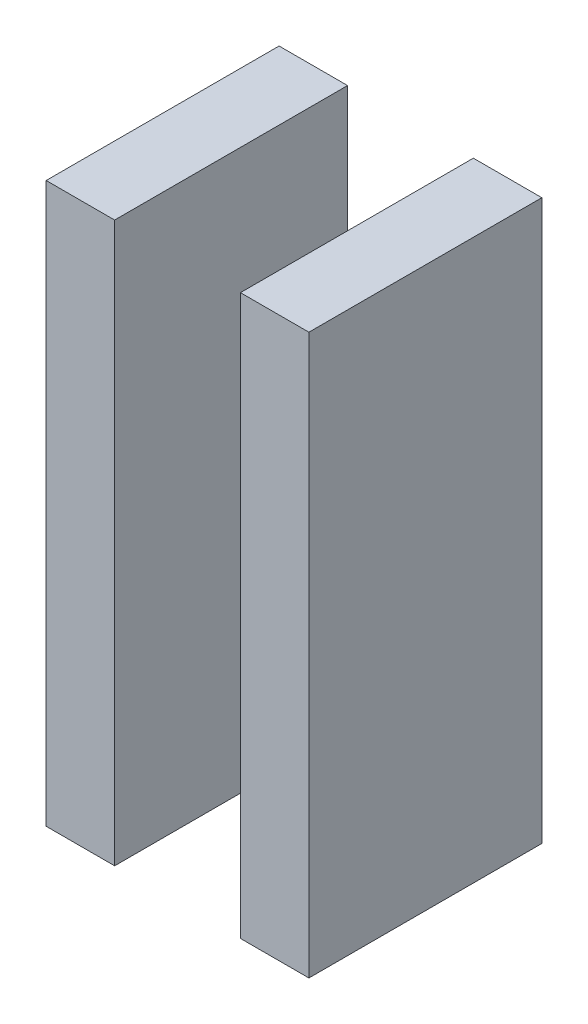
ISO-10303-21;
HEADER;
FILE_DESCRIPTION(('STEP AP214'),'2;1');
FILE_NAME('part.step','',(''),(''),'','','');
FILE_SCHEMA(('AUTOMOTIVE_DESIGN { 1 0 10303 214 1 1 1 1 }'));
ENDSEC;
DATA;
#1=APPLICATION_CONTEXT('core data for automotive mechanical design processes');
#2=APPLICATION_PROTOCOL_DEFINITION('international standard','automotive_design',2000,#1);
#3=PRODUCT_CONTEXT('',#1,'mechanical');
#4=PRODUCT('Part','Part','',(#3));
#5=PRODUCT_RELATED_PRODUCT_CATEGORY('part','',(#4));
#6=PRODUCT_DEFINITION_FORMATION('','',#4);
#7=PRODUCT_DEFINITION_CONTEXT('part definition',#1,'design');
#8=PRODUCT_DEFINITION('design','',#6,#7);
#9=PRODUCT_DEFINITION_SHAPE('','',#8);
#10=(LENGTH_UNIT() NAMED_UNIT(*) SI_UNIT(.MILLI.,.METRE.));
#11=(NAMED_UNIT(*) PLANE_ANGLE_UNIT() SI_UNIT($,.RADIAN.));
#12=(NAMED_UNIT(*) SI_UNIT($,.STERADIAN.) SOLID_ANGLE_UNIT());
#13=UNCERTAINTY_MEASURE_WITH_UNIT(LENGTH_MEASURE(1.E-05),#10,'distance_accuracy_value','');
#14=(GEOMETRIC_REPRESENTATION_CONTEXT(3) GLOBAL_UNCERTAINTY_ASSIGNED_CONTEXT((#13)) GLOBAL_UNIT_ASSIGNED_CONTEXT((#10,
#11,#12)) REPRESENTATION_CONTEXT('',''));
#15=CARTESIAN_POINT('',(0.,0.,0.));
#16=DIRECTION('',(0.,0.,1.));
#17=DIRECTION('',(1.,0.,0.));
#18=AXIS2_PLACEMENT_3D('',#15,#16,#17);
#19=CARTESIAN_POINT('',(203.31,-34.095,10.));
#20=DIRECTION('',(0.,-1.,0.));
#21=DIRECTION('',(0.,0.,-1.));
#22=AXIS2_PLACEMENT_3D('',#19,#20,#21);
#23=PLANE('',#22);
#24=DIRECTION('',(-1.,0.,0.));
#25=VECTOR('',#24,1.);
#26=CARTESIAN_POINT('',(203.31,-34.095,0.));
#27=LINE('',#26,#25);
#28=CARTESIAN_POINT('',(203.31,-34.095,0.));
#29=VERTEX_POINT('',#28);
#30=CARTESIAN_POINT('',(200.37,-34.095,0.));
#31=VERTEX_POINT('',#30);
#32=EDGE_CURVE('E12',#29,#31,#27,.T.);
#33=ORIENTED_EDGE('',*,*,#32,.T.);
#34=DIRECTION('',(0.,0.,-1.));
#35=VECTOR('',#34,1.);
#36=CARTESIAN_POINT('',(200.37,-34.095,10.));
#37=LINE('',#36,#35);
#38=CARTESIAN_POINT('',(200.37,-34.095,10.));
#39=VERTEX_POINT('',#38);
#40=EDGE_CURVE('E118',#39,#31,#37,.T.);
#41=ORIENTED_EDGE('',*,*,#40,.F.);
#42=DIRECTION('',(-1.,0.,0.));
#43=VECTOR('',#42,1.);
#44=CARTESIAN_POINT('',(203.31,-34.095,10.));
#45=LINE('',#44,#43);
#46=CARTESIAN_POINT('',(203.31,-34.095,10.));
#47=VERTEX_POINT('',#46);
#48=EDGE_CURVE('E51',#47,#39,#45,.T.);
#49=ORIENTED_EDGE('',*,*,#48,.F.);
#50=DIRECTION('',(0.,0.,-1.));
#51=VECTOR('',#50,1.);
#52=CARTESIAN_POINT('',(203.31,-34.095,10.));
#53=LINE('',#52,#51);
#54=EDGE_CURVE('E106',#47,#29,#53,.T.);
#55=ORIENTED_EDGE('',*,*,#54,.T.);
#56=EDGE_LOOP('',(#33,#41,#49,#55));
#57=FACE_BOUND('',#56,.T.);
#58=ADVANCED_FACE('F47',(#57),#23,.F.);
#59=CARTESIAN_POINT('',(200.37,-34.095,10.));
#60=DIRECTION('',(1.,0.,0.));
#61=DIRECTION('',(0.,0.,-1.));
#62=AXIS2_PLACEMENT_3D('',#59,#60,#61);
#63=PLANE('',#62);
#64=DIRECTION('',(0.,-1.,0.));
#65=VECTOR('',#64,1.);
#66=CARTESIAN_POINT('',(200.37,-34.095,0.));
#67=LINE('',#66,#65);
#68=CARTESIAN_POINT('',(200.37,-58.105,0.));
#69=VERTEX_POINT('',#68);
#70=EDGE_CURVE('E57',#31,#69,#67,.T.);
#71=ORIENTED_EDGE('',*,*,#70,.T.);
#72=DIRECTION('',(0.,0.,-1.));
#73=VECTOR('',#72,1.);
#74=CARTESIAN_POINT('',(200.37,-58.105,10.));
#75=LINE('',#74,#73);
#76=CARTESIAN_POINT('',(200.37,-58.105,10.));
#77=VERTEX_POINT('',#76);
#78=EDGE_CURVE('E102',#77,#69,#75,.T.);
#79=ORIENTED_EDGE('',*,*,#78,.F.);
#80=DIRECTION('',(0.,-1.,0.));
#81=VECTOR('',#80,1.);
#82=CARTESIAN_POINT('',(200.37,-34.095,10.));
#83=LINE('',#82,#81);
#84=EDGE_CURVE('E81',#39,#77,#83,.T.);
#85=ORIENTED_EDGE('',*,*,#84,.F.);
#86=ORIENTED_EDGE('',*,*,#40,.T.);
#87=EDGE_LOOP('',(#71,#79,#85,#86));
#88=FACE_BOUND('',#87,.T.);
#89=ADVANCED_FACE('F121',(#88),#63,.F.);
#90=CARTESIAN_POINT('',(203.31,-58.105,10.));
#91=DIRECTION('',(0.,1.,0.));
#92=DIRECTION('',(0.,0.,1.));
#93=AXIS2_PLACEMENT_3D('',#90,#91,#92);
#94=PLANE('',#93);
#95=DIRECTION('',(1.,0.,0.));
#96=VECTOR('',#95,1.);
#97=CARTESIAN_POINT('',(203.31,-58.105,0.));
#98=LINE('',#97,#96);
#99=CARTESIAN_POINT('',(203.31,-58.105,0.));
#100=VERTEX_POINT('',#99);
#101=EDGE_CURVE('E97',#69,#100,#98,.T.);
#102=ORIENTED_EDGE('',*,*,#101,.T.);
#103=DIRECTION('',(0.,0.,-1.));
#104=VECTOR('',#103,1.);
#105=CARTESIAN_POINT('',(203.31,-58.105,10.));
#106=LINE('',#105,#104);
#107=CARTESIAN_POINT('',(203.31,-58.105,10.));
#108=VERTEX_POINT('',#107);
#109=EDGE_CURVE('E100',#108,#100,#106,.T.);
#110=ORIENTED_EDGE('',*,*,#109,.F.);
#111=DIRECTION('',(1.,0.,0.));
#112=VECTOR('',#111,1.);
#113=CARTESIAN_POINT('',(203.31,-58.105,10.));
#114=LINE('',#113,#112);
#115=EDGE_CURVE('E114',#77,#108,#114,.T.);
#116=ORIENTED_EDGE('',*,*,#115,.F.);
#117=ORIENTED_EDGE('',*,*,#78,.T.);
#118=EDGE_LOOP('',(#102,#110,#116,#117));
#119=FACE_BOUND('',#118,.T.);
#120=ADVANCED_FACE('F98',(#119),#94,.F.);
#121=CARTESIAN_POINT('',(203.31,-34.095,10.));
#122=DIRECTION('',(-1.,0.,0.));
#123=DIRECTION('',(0.,0.,1.));
#124=AXIS2_PLACEMENT_3D('',#121,#122,#123);
#125=PLANE('',#124);
#126=DIRECTION('',(0.,1.,0.));
#127=VECTOR('',#126,1.);
#128=CARTESIAN_POINT('',(203.31,-34.095,0.));
#129=LINE('',#128,#127);
#130=EDGE_CURVE('E91',#100,#29,#129,.T.);
#131=ORIENTED_EDGE('',*,*,#130,.T.);
#132=ORIENTED_EDGE('',*,*,#54,.F.);
#133=DIRECTION('',(0.,1.,0.));
#134=VECTOR('',#133,1.);
#135=CARTESIAN_POINT('',(203.31,-34.095,10.));
#136=LINE('',#135,#134);
#137=EDGE_CURVE('E105',#108,#47,#136,.T.);
#138=ORIENTED_EDGE('',*,*,#137,.F.);
#139=ORIENTED_EDGE('',*,*,#109,.T.);
#140=EDGE_LOOP('',(#131,#132,#138,#139));
#141=FACE_BOUND('',#140,.T.);
#142=ADVANCED_FACE('F104',(#141),#125,.F.);
#143=CARTESIAN_POINT('',(0.,0.,10.));
#144=DIRECTION('',(0.,0.,1.));
#145=DIRECTION('',(1.,0.,0.));
#146=AXIS2_PLACEMENT_3D('',#143,#144,#145);
#147=PLANE('',#146);
#148=ORIENTED_EDGE('',*,*,#48,.T.);
#149=ORIENTED_EDGE('',*,*,#84,.T.);
#150=ORIENTED_EDGE('',*,*,#115,.T.);
#151=ORIENTED_EDGE('',*,*,#137,.T.);
#152=EDGE_LOOP('',(#148,#149,#150,#151));
#153=FACE_BOUND('',#152,.T.);
#154=ADVANCED_FACE('F49',(#153),#147,.T.);
#155=CARTESIAN_POINT('',(0.,0.,0.));
#156=DIRECTION('',(0.,0.,1.));
#157=DIRECTION('',(1.,0.,0.));
#158=AXIS2_PLACEMENT_3D('',#155,#156,#157);
#159=PLANE('',#158);
#160=ORIENTED_EDGE('',*,*,#32,.F.);
#161=ORIENTED_EDGE('',*,*,#130,.F.);
#162=ORIENTED_EDGE('',*,*,#101,.F.);
#163=ORIENTED_EDGE('',*,*,#70,.F.);
#164=EDGE_LOOP('',(#160,#161,#162,#163));
#165=FACE_BOUND('',#164,.T.);
#166=ADVANCED_FACE('F108',(#165),#159,.F.);
#167=CLOSED_SHELL('',(#58,#89,#120,#142,#154,#166));
#168=MANIFOLD_SOLID_BREP('B2',#167);
#169=CARTESIAN_POINT('',(192.03,-34.095,10.));
#170=DIRECTION('',(1.,0.,0.));
#171=DIRECTION('',(0.,0.,-1.));
#172=AXIS2_PLACEMENT_3D('',#169,#170,#171);
#173=PLANE('',#172);
#174=DIRECTION('',(0.,-1.,0.));
#175=VECTOR('',#174,1.);
#176=CARTESIAN_POINT('',(192.03,-34.095,0.));
#177=LINE('',#176,#175);
#178=CARTESIAN_POINT('',(192.03,-34.095,0.));
#179=VERTEX_POINT('',#178);
#180=CARTESIAN_POINT('',(192.03,-58.105,0.));
#181=VERTEX_POINT('',#180);
#182=EDGE_CURVE('E246',#179,#181,#177,.T.);
#183=ORIENTED_EDGE('',*,*,#182,.T.);
#184=DIRECTION('',(0.,0.,-1.));
#185=VECTOR('',#184,1.);
#186=CARTESIAN_POINT('',(192.03,-58.105,10.));
#187=LINE('',#186,#185);
#188=CARTESIAN_POINT('',(192.03,-58.105,10.));
#189=VERTEX_POINT('',#188);
#190=EDGE_CURVE('E45',#189,#181,#187,.T.);
#191=ORIENTED_EDGE('',*,*,#190,.F.);
#192=DIRECTION('',(0.,-1.,0.));
#193=VECTOR('',#192,1.);
#194=CARTESIAN_POINT('',(192.03,-34.095,10.));
#195=LINE('',#194,#193);
#196=CARTESIAN_POINT('',(192.03,-34.095,10.));
#197=VERTEX_POINT('',#196);
#198=EDGE_CURVE('E234',#197,#189,#195,.T.);
#199=ORIENTED_EDGE('',*,*,#198,.F.);
#200=DIRECTION('',(0.,0.,-1.));
#201=VECTOR('',#200,1.);
#202=CARTESIAN_POINT('',(192.03,-34.095,10.));
#203=LINE('',#202,#201);
#204=EDGE_CURVE('E242',#197,#179,#203,.T.);
#205=ORIENTED_EDGE('',*,*,#204,.T.);
#206=EDGE_LOOP('',(#183,#191,#199,#205));
#207=FACE_BOUND('',#206,.T.);
#208=ADVANCED_FACE('F183',(#207),#173,.F.);
#209=CARTESIAN_POINT('',(192.03,-58.105,10.));
#210=DIRECTION('',(0.,1.,0.));
#211=DIRECTION('',(0.,0.,1.));
#212=AXIS2_PLACEMENT_3D('',#209,#210,#211);
#213=PLANE('',#212);
#214=DIRECTION('',(1.,0.,0.));
#215=VECTOR('',#214,1.);
#216=CARTESIAN_POINT('',(192.03,-58.105,0.));
#217=LINE('',#216,#215);
#218=CARTESIAN_POINT('',(194.97,-58.105,0.));
#219=VERTEX_POINT('',#218);
#220=EDGE_CURVE('E238',#181,#219,#217,.T.);
#221=ORIENTED_EDGE('',*,*,#220,.T.);
#222=DIRECTION('',(0.,0.,-1.));
#223=VECTOR('',#222,1.);
#224=CARTESIAN_POINT('',(194.97,-58.105,10.));
#225=LINE('',#224,#223);
#226=CARTESIAN_POINT('',(194.97,-58.105,10.));
#227=VERTEX_POINT('',#226);
#228=EDGE_CURVE('E191',#227,#219,#225,.T.);
#229=ORIENTED_EDGE('',*,*,#228,.F.);
#230=DIRECTION('',(1.,0.,0.));
#231=VECTOR('',#230,1.);
#232=CARTESIAN_POINT('',(192.03,-58.105,10.));
#233=LINE('',#232,#231);
#234=EDGE_CURVE('E229',#189,#227,#233,.T.);
#235=ORIENTED_EDGE('',*,*,#234,.F.);
#236=ORIENTED_EDGE('',*,*,#190,.T.);
#237=EDGE_LOOP('',(#221,#229,#235,#236));
#238=FACE_BOUND('',#237,.T.);
#239=ADVANCED_FACE('F237',(#238),#213,.F.);
#240=CARTESIAN_POINT('',(194.97,-34.095,10.));
#241=DIRECTION('',(-1.,0.,0.));
#242=DIRECTION('',(0.,0.,1.));
#243=AXIS2_PLACEMENT_3D('',#240,#241,#242);
#244=PLANE('',#243);
#245=DIRECTION('',(0.,1.,0.));
#246=VECTOR('',#245,1.);
#247=CARTESIAN_POINT('',(194.97,-34.095,0.));
#248=LINE('',#247,#246);
#249=CARTESIAN_POINT('',(194.97,-34.095,0.));
#250=VERTEX_POINT('',#249);
#251=EDGE_CURVE('E216',#219,#250,#248,.T.);
#252=ORIENTED_EDGE('',*,*,#251,.T.);
#253=DIRECTION('',(0.,0.,-1.));
#254=VECTOR('',#253,1.);
#255=CARTESIAN_POINT('',(194.97,-34.095,10.));
#256=LINE('',#255,#254);
#257=CARTESIAN_POINT('',(194.97,-34.095,10.));
#258=VERTEX_POINT('',#257);
#259=EDGE_CURVE('E239',#258,#250,#256,.T.);
#260=ORIENTED_EDGE('',*,*,#259,.F.);
#261=DIRECTION('',(0.,1.,0.));
#262=VECTOR('',#261,1.);
#263=CARTESIAN_POINT('',(194.97,-34.095,10.));
#264=LINE('',#263,#262);
#265=EDGE_CURVE('E232',#227,#258,#264,.T.);
#266=ORIENTED_EDGE('',*,*,#265,.F.);
#267=ORIENTED_EDGE('',*,*,#228,.T.);
#268=EDGE_LOOP('',(#252,#260,#266,#267));
#269=FACE_BOUND('',#268,.T.);
#270=ADVANCED_FACE('F240',(#269),#244,.F.);
#271=CARTESIAN_POINT('',(192.03,-34.095,10.));
#272=DIRECTION('',(0.,-1.,0.));
#273=DIRECTION('',(0.,0.,-1.));
#274=AXIS2_PLACEMENT_3D('',#271,#272,#273);
#275=PLANE('',#274);
#276=DIRECTION('',(-1.,0.,0.));
#277=VECTOR('',#276,1.);
#278=CARTESIAN_POINT('',(192.03,-34.095,0.));
#279=LINE('',#278,#277);
#280=EDGE_CURVE('E222',#250,#179,#279,.T.);
#281=ORIENTED_EDGE('',*,*,#280,.T.);
#282=ORIENTED_EDGE('',*,*,#204,.F.);
#283=DIRECTION('',(-1.,0.,0.));
#284=VECTOR('',#283,1.);
#285=CARTESIAN_POINT('',(192.03,-34.095,10.));
#286=LINE('',#285,#284);
#287=EDGE_CURVE('E199',#258,#197,#286,.T.);
#288=ORIENTED_EDGE('',*,*,#287,.F.);
#289=ORIENTED_EDGE('',*,*,#259,.T.);
#290=EDGE_LOOP('',(#281,#282,#288,#289));
#291=FACE_BOUND('',#290,.T.);
#292=ADVANCED_FACE('F253',(#291),#275,.F.);
#293=CARTESIAN_POINT('',(0.,0.,10.));
#294=DIRECTION('',(0.,0.,1.));
#295=DIRECTION('',(1.,0.,0.));
#296=AXIS2_PLACEMENT_3D('',#293,#294,#295);
#297=PLANE('',#296);
#298=ORIENTED_EDGE('',*,*,#198,.T.);
#299=ORIENTED_EDGE('',*,*,#234,.T.);
#300=ORIENTED_EDGE('',*,*,#265,.T.);
#301=ORIENTED_EDGE('',*,*,#287,.T.);
#302=EDGE_LOOP('',(#298,#299,#300,#301));
#303=FACE_BOUND('',#302,.T.);
#304=ADVANCED_FACE('F230',(#303),#297,.T.);
#305=CARTESIAN_POINT('',(0.,0.,0.));
#306=DIRECTION('',(0.,0.,1.));
#307=DIRECTION('',(1.,0.,0.));
#308=AXIS2_PLACEMENT_3D('',#305,#306,#307);
#309=PLANE('',#308);
#310=ORIENTED_EDGE('',*,*,#182,.F.);
#311=ORIENTED_EDGE('',*,*,#280,.F.);
#312=ORIENTED_EDGE('',*,*,#251,.F.);
#313=ORIENTED_EDGE('',*,*,#220,.F.);
#314=EDGE_LOOP('',(#310,#311,#312,#313));
#315=FACE_BOUND('',#314,.T.);
#316=ADVANCED_FACE('F256',(#315),#309,.F.);
#317=CLOSED_SHELL('',(#208,#239,#270,#292,#304,#316));
#318=MANIFOLD_SOLID_BREP('B6',#317);
#319=ADVANCED_BREP_SHAPE_REPRESENTATION('',(#18,#168,#318),#14);
#320=SHAPE_DEFINITION_REPRESENTATION(#9,#319);
ENDSEC;
END-ISO-10303-21;
